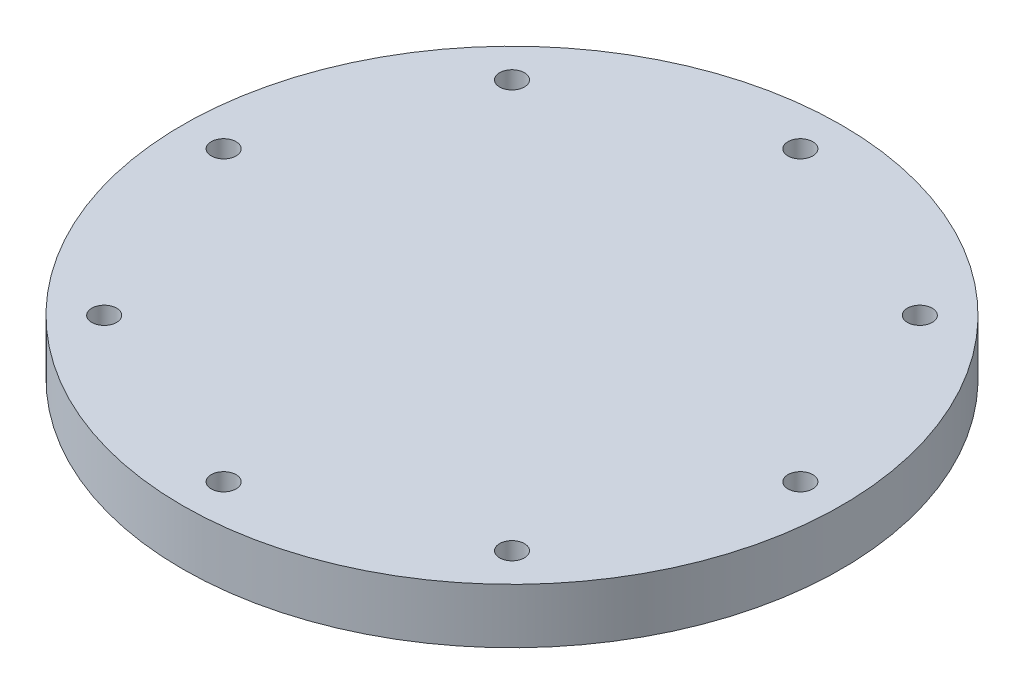
ISO-10303-21;
HEADER;
FILE_DESCRIPTION(('STEP AP214'),'2;1');
FILE_NAME('part.step','',(''),(''),'','','');
FILE_SCHEMA(('AUTOMOTIVE_DESIGN { 1 0 10303 214 1 1 1 1 }'));
ENDSEC;
DATA;
#1=APPLICATION_CONTEXT('core data for automotive mechanical design processes');
#2=APPLICATION_PROTOCOL_DEFINITION('international standard','automotive_design',2000,#1);
#3=PRODUCT_CONTEXT('',#1,'mechanical');
#4=PRODUCT('Part','Part','',(#3));
#5=PRODUCT_RELATED_PRODUCT_CATEGORY('part','',(#4));
#6=PRODUCT_DEFINITION_FORMATION('','',#4);
#7=PRODUCT_DEFINITION_CONTEXT('part definition',#1,'design');
#8=PRODUCT_DEFINITION('design','',#6,#7);
#9=PRODUCT_DEFINITION_SHAPE('','',#8);
#10=(LENGTH_UNIT() NAMED_UNIT(*) SI_UNIT(.MILLI.,.METRE.));
#11=(NAMED_UNIT(*) PLANE_ANGLE_UNIT() SI_UNIT($,.RADIAN.));
#12=(NAMED_UNIT(*) SI_UNIT($,.STERADIAN.) SOLID_ANGLE_UNIT());
#13=UNCERTAINTY_MEASURE_WITH_UNIT(LENGTH_MEASURE(1.E-05),#10,'distance_accuracy_value','');
#14=(GEOMETRIC_REPRESENTATION_CONTEXT(3) GLOBAL_UNCERTAINTY_ASSIGNED_CONTEXT((#13)) GLOBAL_UNIT_ASSIGNED_CONTEXT((#10,
#11,#12)) REPRESENTATION_CONTEXT('',''));
#15=CARTESIAN_POINT('',(0.,0.,0.));
#16=DIRECTION('',(0.,0.,1.));
#17=DIRECTION('',(1.,0.,0.));
#18=AXIS2_PLACEMENT_3D('',#15,#16,#17);
#19=CARTESIAN_POINT('',(0.,6.35,0.));
#20=DIRECTION('',(0.,-1.,0.));
#21=DIRECTION('',(0.,0.,-1.));
#22=AXIS2_PLACEMENT_3D('',#19,#20,#21);
#23=CYLINDRICAL_SURFACE('',#22,38.1);
#24=CARTESIAN_POINT('',(0.,6.35,0.));
#25=DIRECTION('',(0.,1.,0.));
#26=DIRECTION('',(0.,0.,1.));
#27=AXIS2_PLACEMENT_3D('',#24,#25,#26);
#28=CIRCLE('',#27,38.1);
#29=CARTESIAN_POINT('',(0.,6.35,38.1));
#30=VERTEX_POINT('',#29);
#31=EDGE_CURVE('E10',#30,#30,#28,.T.);
#32=ORIENTED_EDGE('',*,*,#31,.F.);
#33=EDGE_LOOP('',(#32));
#34=FACE_BOUND('',#33,.T.);
#35=CARTESIAN_POINT('',(0.,0.,0.));
#36=DIRECTION('',(0.,1.,0.));
#37=DIRECTION('',(0.,0.,1.));
#38=AXIS2_PLACEMENT_3D('',#35,#36,#37);
#39=CIRCLE('',#38,38.1);
#40=CARTESIAN_POINT('',(0.,0.,38.1));
#41=VERTEX_POINT('',#40);
#42=EDGE_CURVE('E33',#41,#41,#39,.T.);
#43=ORIENTED_EDGE('',*,*,#42,.T.);
#44=EDGE_LOOP('',(#43));
#45=FACE_BOUND('',#44,.T.);
#46=ADVANCED_FACE('F30',(#34,#45),#23,.T.);
#47=CARTESIAN_POINT('',(0.,6.35,0.));
#48=DIRECTION('',(0.,1.,0.));
#49=DIRECTION('',(0.,0.,1.));
#50=AXIS2_PLACEMENT_3D('',#47,#48,#49);
#51=PLANE('',#50);
#52=CARTESIAN_POINT('',(-23.5731723178062,6.35,23.5731723178068));
#53=DIRECTION('',(0.,-1.,0.));
#54=DIRECTION('',(0.,0.,-1.));
#55=AXIS2_PLACEMENT_3D('',#52,#53,#54);
#56=CIRCLE('',#55,1.4351);
#57=CARTESIAN_POINT('',(-23.5731723178062,6.35,22.1380723178068));
#58=VERTEX_POINT('',#57);
#59=EDGE_CURVE('E125',#58,#58,#56,.T.);
#60=ORIENTED_EDGE('',*,*,#59,.T.);
#61=EDGE_LOOP('',(#60));
#62=FACE_BOUND('',#61,.T.);
#63=CARTESIAN_POINT('',(-33.3375,6.35,3.49191777401049E-13));
#64=DIRECTION('',(0.,-1.,0.));
#65=DIRECTION('',(0.,0.,-1.));
#66=AXIS2_PLACEMENT_3D('',#63,#64,#65);
#67=CIRCLE('',#66,1.4351);
#68=CARTESIAN_POINT('',(-33.3375,6.35,-1.43509999999965));
#69=VERTEX_POINT('',#68);
#70=EDGE_CURVE('E113',#69,#69,#67,.T.);
#71=ORIENTED_EDGE('',*,*,#70,.T.);
#72=EDGE_LOOP('',(#71));
#73=FACE_BOUND('',#72,.T.);
#74=CARTESIAN_POINT('',(-23.5731723178067,6.35,-23.5731723178063));
#75=DIRECTION('',(0.,-1.,0.));
#76=DIRECTION('',(0.,0.,-1.));
#77=AXIS2_PLACEMENT_3D('',#74,#75,#76);
#78=CIRCLE('',#77,1.4351);
#79=CARTESIAN_POINT('',(-23.5731723178067,6.35,-25.0082723178063));
#80=VERTEX_POINT('',#79);
#81=EDGE_CURVE('E101',#80,#80,#78,.T.);
#82=ORIENTED_EDGE('',*,*,#81,.T.);
#83=EDGE_LOOP('',(#82));
#84=FACE_BOUND('',#83,.T.);
#85=CARTESIAN_POINT('',(0.,6.35,-33.3375));
#86=DIRECTION('',(0.,-1.,0.));
#87=DIRECTION('',(0.,0.,-1.));
#88=AXIS2_PLACEMENT_3D('',#85,#86,#87);
#89=CIRCLE('',#88,1.4351);
#90=CARTESIAN_POINT('',(0.,6.35,-34.7726));
#91=VERTEX_POINT('',#90);
#92=EDGE_CURVE('E89',#91,#91,#89,.T.);
#93=ORIENTED_EDGE('',*,*,#92,.T.);
#94=EDGE_LOOP('',(#93));
#95=FACE_BOUND('',#94,.T.);
#96=CARTESIAN_POINT('',(23.5731723178064,6.35,-23.5731723178067));
#97=DIRECTION('',(0.,-1.,0.));
#98=DIRECTION('',(0.,0.,-1.));
#99=AXIS2_PLACEMENT_3D('',#96,#97,#98);
#100=CIRCLE('',#99,1.4351);
#101=CARTESIAN_POINT('',(23.5731723178064,6.35,-25.0082723178067));
#102=VERTEX_POINT('',#101);
#103=EDGE_CURVE('E77',#102,#102,#100,.T.);
#104=ORIENTED_EDGE('',*,*,#103,.T.);
#105=EDGE_LOOP('',(#104));
#106=FACE_BOUND('',#105,.T.);
#107=CARTESIAN_POINT('',(33.3375,6.35,-1.16397259133683E-13));
#108=DIRECTION('',(0.,-1.,0.));
#109=DIRECTION('',(0.,0.,-1.));
#110=AXIS2_PLACEMENT_3D('',#107,#108,#109);
#111=CIRCLE('',#110,1.4351);
#112=CARTESIAN_POINT('',(33.3375,6.35,-1.43510000000012));
#113=VERTEX_POINT('',#112);
#114=EDGE_CURVE('E65',#113,#113,#111,.T.);
#115=ORIENTED_EDGE('',*,*,#114,.T.);
#116=EDGE_LOOP('',(#115));
#117=FACE_BOUND('',#116,.T.);
#118=CARTESIAN_POINT('',(23.5731723178066,6.35,23.5731723178065));
#119=DIRECTION('',(0.,-1.,0.));
#120=DIRECTION('',(0.,0.,-1.));
#121=AXIS2_PLACEMENT_3D('',#118,#119,#120);
#122=CIRCLE('',#121,1.4351);
#123=CARTESIAN_POINT('',(23.5731723178066,6.35,22.1380723178065));
#124=VERTEX_POINT('',#123);
#125=EDGE_CURVE('E53',#124,#124,#122,.T.);
#126=ORIENTED_EDGE('',*,*,#125,.T.);
#127=EDGE_LOOP('',(#126));
#128=FACE_BOUND('',#127,.T.);
#129=CARTESIAN_POINT('',(0.,6.35,33.3375));
#130=DIRECTION('',(0.,-1.,0.));
#131=DIRECTION('',(0.,0.,-1.));
#132=AXIS2_PLACEMENT_3D('',#129,#130,#131);
#133=CIRCLE('',#132,1.4351);
#134=CARTESIAN_POINT('',(0.,6.35,31.9024));
#135=VERTEX_POINT('',#134);
#136=EDGE_CURVE('E40',#135,#135,#133,.T.);
#137=ORIENTED_EDGE('',*,*,#136,.T.);
#138=EDGE_LOOP('',(#137));
#139=FACE_BOUND('',#138,.T.);
#140=ORIENTED_EDGE('',*,*,#31,.T.);
#141=EDGE_LOOP('',(#140));
#142=FACE_BOUND('',#141,.T.);
#143=ADVANCED_FACE('F144',(#62,#73,#84,#95,#106,#117,#128,#139,#142),#51,.T.);
#144=CARTESIAN_POINT('',(0.,0.,0.));
#145=DIRECTION('',(0.,1.,0.));
#146=DIRECTION('',(0.,0.,1.));
#147=AXIS2_PLACEMENT_3D('',#144,#145,#146);
#148=PLANE('',#147);
#149=CARTESIAN_POINT('',(-23.5731723178062,0.,23.5731723178068));
#150=DIRECTION('',(0.,-1.,0.));
#151=DIRECTION('',(0.,0.,-1.));
#152=AXIS2_PLACEMENT_3D('',#149,#150,#151);
#153=CIRCLE('',#152,2.413);
#154=CARTESIAN_POINT('',(-23.5731723178062,0.,21.1601723178068));
#155=VERTEX_POINT('',#154);
#156=EDGE_CURVE('E134',#155,#155,#153,.T.);
#157=ORIENTED_EDGE('',*,*,#156,.F.);
#158=EDGE_LOOP('',(#157));
#159=FACE_BOUND('',#158,.T.);
#160=CARTESIAN_POINT('',(-33.3375,0.,3.49191777401049E-13));
#161=DIRECTION('',(0.,-1.,0.));
#162=DIRECTION('',(0.,0.,-1.));
#163=AXIS2_PLACEMENT_3D('',#160,#161,#162);
#164=CIRCLE('',#163,2.413);
#165=CARTESIAN_POINT('',(-33.3375,0.,-2.41299999999965));
#166=VERTEX_POINT('',#165);
#167=EDGE_CURVE('E122',#166,#166,#164,.T.);
#168=ORIENTED_EDGE('',*,*,#167,.F.);
#169=EDGE_LOOP('',(#168));
#170=FACE_BOUND('',#169,.T.);
#171=CARTESIAN_POINT('',(-23.5731723178067,0.,-23.5731723178063));
#172=DIRECTION('',(0.,-1.,0.));
#173=DIRECTION('',(0.,0.,-1.));
#174=AXIS2_PLACEMENT_3D('',#171,#172,#173);
#175=CIRCLE('',#174,2.413);
#176=CARTESIAN_POINT('',(-23.5731723178067,0.,-25.9861723178063));
#177=VERTEX_POINT('',#176);
#178=EDGE_CURVE('E110',#177,#177,#175,.T.);
#179=ORIENTED_EDGE('',*,*,#178,.F.);
#180=EDGE_LOOP('',(#179));
#181=FACE_BOUND('',#180,.T.);
#182=CARTESIAN_POINT('',(0.,0.,-33.3375));
#183=DIRECTION('',(0.,-1.,0.));
#184=DIRECTION('',(0.,0.,-1.));
#185=AXIS2_PLACEMENT_3D('',#182,#183,#184);
#186=CIRCLE('',#185,2.413);
#187=CARTESIAN_POINT('',(0.,0.,-35.7505));
#188=VERTEX_POINT('',#187);
#189=EDGE_CURVE('E98',#188,#188,#186,.T.);
#190=ORIENTED_EDGE('',*,*,#189,.F.);
#191=EDGE_LOOP('',(#190));
#192=FACE_BOUND('',#191,.T.);
#193=CARTESIAN_POINT('',(23.5731723178064,0.,-23.5731723178067));
#194=DIRECTION('',(0.,-1.,0.));
#195=DIRECTION('',(0.,0.,-1.));
#196=AXIS2_PLACEMENT_3D('',#193,#194,#195);
#197=CIRCLE('',#196,2.413);
#198=CARTESIAN_POINT('',(23.5731723178064,0.,-25.9861723178067));
#199=VERTEX_POINT('',#198);
#200=EDGE_CURVE('E86',#199,#199,#197,.T.);
#201=ORIENTED_EDGE('',*,*,#200,.F.);
#202=EDGE_LOOP('',(#201));
#203=FACE_BOUND('',#202,.T.);
#204=CARTESIAN_POINT('',(33.3375,0.,-1.16397259133683E-13));
#205=DIRECTION('',(0.,-1.,0.));
#206=DIRECTION('',(0.,0.,-1.));
#207=AXIS2_PLACEMENT_3D('',#204,#205,#206);
#208=CIRCLE('',#207,2.413);
#209=CARTESIAN_POINT('',(33.3375,0.,-2.41300000000011));
#210=VERTEX_POINT('',#209);
#211=EDGE_CURVE('E74',#210,#210,#208,.T.);
#212=ORIENTED_EDGE('',*,*,#211,.F.);
#213=EDGE_LOOP('',(#212));
#214=FACE_BOUND('',#213,.T.);
#215=CARTESIAN_POINT('',(23.5731723178066,0.,23.5731723178065));
#216=DIRECTION('',(0.,-1.,0.));
#217=DIRECTION('',(0.,0.,-1.));
#218=AXIS2_PLACEMENT_3D('',#215,#216,#217);
#219=CIRCLE('',#218,2.413);
#220=CARTESIAN_POINT('',(23.5731723178066,0.,21.1601723178065));
#221=VERTEX_POINT('',#220);
#222=EDGE_CURVE('E62',#221,#221,#219,.T.);
#223=ORIENTED_EDGE('',*,*,#222,.F.);
#224=EDGE_LOOP('',(#223));
#225=FACE_BOUND('',#224,.T.);
#226=CARTESIAN_POINT('',(0.,0.,33.3375));
#227=DIRECTION('',(0.,-1.,0.));
#228=DIRECTION('',(0.,0.,-1.));
#229=AXIS2_PLACEMENT_3D('',#226,#227,#228);
#230=CIRCLE('',#229,2.413);
#231=CARTESIAN_POINT('',(0.,0.,30.9245));
#232=VERTEX_POINT('',#231);
#233=EDGE_CURVE('E50',#232,#232,#230,.T.);
#234=ORIENTED_EDGE('',*,*,#233,.F.);
#235=EDGE_LOOP('',(#234));
#236=FACE_BOUND('',#235,.T.);
#237=ORIENTED_EDGE('',*,*,#42,.F.);
#238=EDGE_LOOP('',(#237));
#239=FACE_BOUND('',#238,.T.);
#240=ADVANCED_FACE('F140',(#159,#170,#181,#192,#203,#214,#225,#236,#239),#148,.F.);
#241=CARTESIAN_POINT('',(0.,0.,33.3375));
#242=DIRECTION('',(0.,-1.,0.));
#243=DIRECTION('',(0.,0.,-1.));
#244=AXIS2_PLACEMENT_3D('',#241,#242,#243);
#245=CYLINDRICAL_SURFACE('',#244,1.4351);
#246=ORIENTED_EDGE('',*,*,#136,.F.);
#247=EDGE_LOOP('',(#246));
#248=FACE_BOUND('',#247,.T.);
#249=CARTESIAN_POINT('',(0.,1.905,33.3375));
#250=DIRECTION('',(0.,-1.,0.));
#251=DIRECTION('',(0.,0.,-1.));
#252=AXIS2_PLACEMENT_3D('',#249,#250,#251);
#253=CIRCLE('',#252,1.4351);
#254=CARTESIAN_POINT('',(0.,1.905,31.9024));
#255=VERTEX_POINT('',#254);
#256=EDGE_CURVE('E44',#255,#255,#253,.T.);
#257=ORIENTED_EDGE('',*,*,#256,.T.);
#258=EDGE_LOOP('',(#257));
#259=FACE_BOUND('',#258,.T.);
#260=ADVANCED_FACE('F143',(#248,#259),#245,.F.);
#261=CARTESIAN_POINT('',(1.4351,1.905,33.3375));
#262=DIRECTION('',(0.,1.,0.));
#263=DIRECTION('',(0.,0.,1.));
#264=AXIS2_PLACEMENT_3D('',#261,#262,#263);
#265=PLANE('',#264);
#266=ORIENTED_EDGE('',*,*,#256,.F.);
#267=EDGE_LOOP('',(#266));
#268=FACE_BOUND('',#267,.T.);
#269=CARTESIAN_POINT('',(0.,1.905,33.3375));
#270=DIRECTION('',(0.,-1.,0.));
#271=DIRECTION('',(0.,0.,-1.));
#272=AXIS2_PLACEMENT_3D('',#269,#270,#271);
#273=CIRCLE('',#272,2.413);
#274=CARTESIAN_POINT('',(0.,1.905,30.9245));
#275=VERTEX_POINT('',#274);
#276=EDGE_CURVE('E47',#275,#275,#273,.T.);
#277=ORIENTED_EDGE('',*,*,#276,.T.);
#278=EDGE_LOOP('',(#277));
#279=FACE_BOUND('',#278,.T.);
#280=ADVANCED_FACE('F174',(#268,#279),#265,.F.);
#281=CARTESIAN_POINT('',(0.,0.,33.3375));
#282=DIRECTION('',(0.,-1.,0.));
#283=DIRECTION('',(0.,0.,-1.));
#284=AXIS2_PLACEMENT_3D('',#281,#282,#283);
#285=CYLINDRICAL_SURFACE('',#284,2.413);
#286=ORIENTED_EDGE('',*,*,#276,.F.);
#287=EDGE_LOOP('',(#286));
#288=FACE_BOUND('',#287,.T.);
#289=ORIENTED_EDGE('',*,*,#233,.T.);
#290=EDGE_LOOP('',(#289));
#291=FACE_BOUND('',#290,.T.);
#292=ADVANCED_FACE('F178',(#288,#291),#285,.F.);
#293=CARTESIAN_POINT('',(23.5731723178066,0.,23.5731723178065));
#294=DIRECTION('',(0.,-1.,0.));
#295=DIRECTION('',(0.,0.,-1.));
#296=AXIS2_PLACEMENT_3D('',#293,#294,#295);
#297=CYLINDRICAL_SURFACE('',#296,1.4351);
#298=ORIENTED_EDGE('',*,*,#125,.F.);
#299=EDGE_LOOP('',(#298));
#300=FACE_BOUND('',#299,.T.);
#301=CARTESIAN_POINT('',(23.5731723178066,1.905,23.5731723178065));
#302=DIRECTION('',(0.,-1.,0.));
#303=DIRECTION('',(0.,0.,-1.));
#304=AXIS2_PLACEMENT_3D('',#301,#302,#303);
#305=CIRCLE('',#304,1.4351);
#306=CARTESIAN_POINT('',(23.5731723178066,1.905,22.1380723178065));
#307=VERTEX_POINT('',#306);
#308=EDGE_CURVE('E56',#307,#307,#305,.T.);
#309=ORIENTED_EDGE('',*,*,#308,.T.);
#310=EDGE_LOOP('',(#309));
#311=FACE_BOUND('',#310,.T.);
#312=ADVANCED_FACE('F182',(#300,#311),#297,.F.);
#313=CARTESIAN_POINT('',(25.0082723178066,1.905,23.5731723178065));
#314=DIRECTION('',(0.,1.,0.));
#315=DIRECTION('',(0.,0.,1.));
#316=AXIS2_PLACEMENT_3D('',#313,#314,#315);
#317=PLANE('',#316);
#318=ORIENTED_EDGE('',*,*,#308,.F.);
#319=EDGE_LOOP('',(#318));
#320=FACE_BOUND('',#319,.T.);
#321=CARTESIAN_POINT('',(23.5731723178066,1.905,23.5731723178065));
#322=DIRECTION('',(0.,-1.,0.));
#323=DIRECTION('',(0.,0.,-1.));
#324=AXIS2_PLACEMENT_3D('',#321,#322,#323);
#325=CIRCLE('',#324,2.413);
#326=CARTESIAN_POINT('',(23.5731723178066,1.905,21.1601723178065));
#327=VERTEX_POINT('',#326);
#328=EDGE_CURVE('E59',#327,#327,#325,.T.);
#329=ORIENTED_EDGE('',*,*,#328,.T.);
#330=EDGE_LOOP('',(#329));
#331=FACE_BOUND('',#330,.T.);
#332=ADVANCED_FACE('F186',(#320,#331),#317,.F.);
#333=CARTESIAN_POINT('',(23.5731723178066,0.,23.5731723178065));
#334=DIRECTION('',(0.,-1.,0.));
#335=DIRECTION('',(0.,0.,-1.));
#336=AXIS2_PLACEMENT_3D('',#333,#334,#335);
#337=CYLINDRICAL_SURFACE('',#336,2.413);
#338=ORIENTED_EDGE('',*,*,#328,.F.);
#339=EDGE_LOOP('',(#338));
#340=FACE_BOUND('',#339,.T.);
#341=ORIENTED_EDGE('',*,*,#222,.T.);
#342=EDGE_LOOP('',(#341));
#343=FACE_BOUND('',#342,.T.);
#344=ADVANCED_FACE('F190',(#340,#343),#337,.F.);
#345=CARTESIAN_POINT('',(33.3375,0.,-1.16397259133683E-13));
#346=DIRECTION('',(0.,-1.,0.));
#347=DIRECTION('',(0.,0.,-1.));
#348=AXIS2_PLACEMENT_3D('',#345,#346,#347);
#349=CYLINDRICAL_SURFACE('',#348,1.4351);
#350=ORIENTED_EDGE('',*,*,#114,.F.);
#351=EDGE_LOOP('',(#350));
#352=FACE_BOUND('',#351,.T.);
#353=CARTESIAN_POINT('',(33.3375,1.905,-1.16397259133683E-13));
#354=DIRECTION('',(0.,-1.,0.));
#355=DIRECTION('',(0.,0.,-1.));
#356=AXIS2_PLACEMENT_3D('',#353,#354,#355);
#357=CIRCLE('',#356,1.4351);
#358=CARTESIAN_POINT('',(33.3375,1.905,-1.43510000000012));
#359=VERTEX_POINT('',#358);
#360=EDGE_CURVE('E68',#359,#359,#357,.T.);
#361=ORIENTED_EDGE('',*,*,#360,.T.);
#362=EDGE_LOOP('',(#361));
#363=FACE_BOUND('',#362,.T.);
#364=ADVANCED_FACE('F194',(#352,#363),#349,.F.);
#365=CARTESIAN_POINT('',(34.7726,1.905,-1.16397259133683E-13));
#366=DIRECTION('',(0.,1.,0.));
#367=DIRECTION('',(0.,0.,1.));
#368=AXIS2_PLACEMENT_3D('',#365,#366,#367);
#369=PLANE('',#368);
#370=ORIENTED_EDGE('',*,*,#360,.F.);
#371=EDGE_LOOP('',(#370));
#372=FACE_BOUND('',#371,.T.);
#373=CARTESIAN_POINT('',(33.3375,1.905,-1.16397259133683E-13));
#374=DIRECTION('',(0.,-1.,0.));
#375=DIRECTION('',(0.,0.,-1.));
#376=AXIS2_PLACEMENT_3D('',#373,#374,#375);
#377=CIRCLE('',#376,2.413);
#378=CARTESIAN_POINT('',(33.3375,1.905,-2.41300000000011));
#379=VERTEX_POINT('',#378);
#380=EDGE_CURVE('E71',#379,#379,#377,.T.);
#381=ORIENTED_EDGE('',*,*,#380,.T.);
#382=EDGE_LOOP('',(#381));
#383=FACE_BOUND('',#382,.T.);
#384=ADVANCED_FACE('F198',(#372,#383),#369,.F.);
#385=CARTESIAN_POINT('',(33.3375,0.,-1.16397259133683E-13));
#386=DIRECTION('',(0.,-1.,0.));
#387=DIRECTION('',(0.,0.,-1.));
#388=AXIS2_PLACEMENT_3D('',#385,#386,#387);
#389=CYLINDRICAL_SURFACE('',#388,2.413);
#390=ORIENTED_EDGE('',*,*,#380,.F.);
#391=EDGE_LOOP('',(#390));
#392=FACE_BOUND('',#391,.T.);
#393=ORIENTED_EDGE('',*,*,#211,.T.);
#394=EDGE_LOOP('',(#393));
#395=FACE_BOUND('',#394,.T.);
#396=ADVANCED_FACE('F202',(#392,#395),#389,.F.);
#397=CARTESIAN_POINT('',(23.5731723178064,0.,-23.5731723178067));
#398=DIRECTION('',(0.,-1.,0.));
#399=DIRECTION('',(0.,0.,-1.));
#400=AXIS2_PLACEMENT_3D('',#397,#398,#399);
#401=CYLINDRICAL_SURFACE('',#400,1.4351);
#402=ORIENTED_EDGE('',*,*,#103,.F.);
#403=EDGE_LOOP('',(#402));
#404=FACE_BOUND('',#403,.T.);
#405=CARTESIAN_POINT('',(23.5731723178064,1.905,-23.5731723178067));
#406=DIRECTION('',(0.,-1.,0.));
#407=DIRECTION('',(0.,0.,-1.));
#408=AXIS2_PLACEMENT_3D('',#405,#406,#407);
#409=CIRCLE('',#408,1.4351);
#410=CARTESIAN_POINT('',(23.5731723178064,1.905,-25.0082723178067));
#411=VERTEX_POINT('',#410);
#412=EDGE_CURVE('E80',#411,#411,#409,.T.);
#413=ORIENTED_EDGE('',*,*,#412,.T.);
#414=EDGE_LOOP('',(#413));
#415=FACE_BOUND('',#414,.T.);
#416=ADVANCED_FACE('F206',(#404,#415),#401,.F.);
#417=CARTESIAN_POINT('',(25.0082723178064,1.905,-23.5731723178067));
#418=DIRECTION('',(0.,1.,0.));
#419=DIRECTION('',(0.,0.,1.));
#420=AXIS2_PLACEMENT_3D('',#417,#418,#419);
#421=PLANE('',#420);
#422=ORIENTED_EDGE('',*,*,#412,.F.);
#423=EDGE_LOOP('',(#422));
#424=FACE_BOUND('',#423,.T.);
#425=CARTESIAN_POINT('',(23.5731723178064,1.905,-23.5731723178067));
#426=DIRECTION('',(0.,-1.,0.));
#427=DIRECTION('',(0.,0.,-1.));
#428=AXIS2_PLACEMENT_3D('',#425,#426,#427);
#429=CIRCLE('',#428,2.413);
#430=CARTESIAN_POINT('',(23.5731723178064,1.905,-25.9861723178067));
#431=VERTEX_POINT('',#430);
#432=EDGE_CURVE('E83',#431,#431,#429,.T.);
#433=ORIENTED_EDGE('',*,*,#432,.T.);
#434=EDGE_LOOP('',(#433));
#435=FACE_BOUND('',#434,.T.);
#436=ADVANCED_FACE('F210',(#424,#435),#421,.F.);
#437=CARTESIAN_POINT('',(23.5731723178064,0.,-23.5731723178067));
#438=DIRECTION('',(0.,-1.,0.));
#439=DIRECTION('',(0.,0.,-1.));
#440=AXIS2_PLACEMENT_3D('',#437,#438,#439);
#441=CYLINDRICAL_SURFACE('',#440,2.413);
#442=ORIENTED_EDGE('',*,*,#432,.F.);
#443=EDGE_LOOP('',(#442));
#444=FACE_BOUND('',#443,.T.);
#445=ORIENTED_EDGE('',*,*,#200,.T.);
#446=EDGE_LOOP('',(#445));
#447=FACE_BOUND('',#446,.T.);
#448=ADVANCED_FACE('F214',(#444,#447),#441,.F.);
#449=CARTESIAN_POINT('',(0.,0.,-33.3375));
#450=DIRECTION('',(0.,-1.,0.));
#451=DIRECTION('',(0.,0.,-1.));
#452=AXIS2_PLACEMENT_3D('',#449,#450,#451);
#453=CYLINDRICAL_SURFACE('',#452,1.4351);
#454=ORIENTED_EDGE('',*,*,#92,.F.);
#455=EDGE_LOOP('',(#454));
#456=FACE_BOUND('',#455,.T.);
#457=CARTESIAN_POINT('',(0.,1.905,-33.3375));
#458=DIRECTION('',(0.,-1.,0.));
#459=DIRECTION('',(0.,0.,-1.));
#460=AXIS2_PLACEMENT_3D('',#457,#458,#459);
#461=CIRCLE('',#460,1.4351);
#462=CARTESIAN_POINT('',(0.,1.905,-34.7726));
#463=VERTEX_POINT('',#462);
#464=EDGE_CURVE('E92',#463,#463,#461,.T.);
#465=ORIENTED_EDGE('',*,*,#464,.T.);
#466=EDGE_LOOP('',(#465));
#467=FACE_BOUND('',#466,.T.);
#468=ADVANCED_FACE('F218',(#456,#467),#453,.F.);
#469=CARTESIAN_POINT('',(1.4351,1.905,-33.3375));
#470=DIRECTION('',(0.,1.,0.));
#471=DIRECTION('',(0.,0.,1.));
#472=AXIS2_PLACEMENT_3D('',#469,#470,#471);
#473=PLANE('',#472);
#474=ORIENTED_EDGE('',*,*,#464,.F.);
#475=EDGE_LOOP('',(#474));
#476=FACE_BOUND('',#475,.T.);
#477=CARTESIAN_POINT('',(0.,1.905,-33.3375));
#478=DIRECTION('',(0.,-1.,0.));
#479=DIRECTION('',(0.,0.,-1.));
#480=AXIS2_PLACEMENT_3D('',#477,#478,#479);
#481=CIRCLE('',#480,2.413);
#482=CARTESIAN_POINT('',(0.,1.905,-35.7505));
#483=VERTEX_POINT('',#482);
#484=EDGE_CURVE('E95',#483,#483,#481,.T.);
#485=ORIENTED_EDGE('',*,*,#484,.T.);
#486=EDGE_LOOP('',(#485));
#487=FACE_BOUND('',#486,.T.);
#488=ADVANCED_FACE('F222',(#476,#487),#473,.F.);
#489=CARTESIAN_POINT('',(0.,0.,-33.3375));
#490=DIRECTION('',(0.,-1.,0.));
#491=DIRECTION('',(0.,0.,-1.));
#492=AXIS2_PLACEMENT_3D('',#489,#490,#491);
#493=CYLINDRICAL_SURFACE('',#492,2.413);
#494=ORIENTED_EDGE('',*,*,#484,.F.);
#495=EDGE_LOOP('',(#494));
#496=FACE_BOUND('',#495,.T.);
#497=ORIENTED_EDGE('',*,*,#189,.T.);
#498=EDGE_LOOP('',(#497));
#499=FACE_BOUND('',#498,.T.);
#500=ADVANCED_FACE('F226',(#496,#499),#493,.F.);
#501=CARTESIAN_POINT('',(-23.5731723178067,0.,-23.5731723178063));
#502=DIRECTION('',(0.,-1.,0.));
#503=DIRECTION('',(0.,0.,-1.));
#504=AXIS2_PLACEMENT_3D('',#501,#502,#503);
#505=CYLINDRICAL_SURFACE('',#504,1.4351);
#506=ORIENTED_EDGE('',*,*,#81,.F.);
#507=EDGE_LOOP('',(#506));
#508=FACE_BOUND('',#507,.T.);
#509=CARTESIAN_POINT('',(-23.5731723178067,1.905,-23.5731723178063));
#510=DIRECTION('',(0.,-1.,0.));
#511=DIRECTION('',(0.,0.,-1.));
#512=AXIS2_PLACEMENT_3D('',#509,#510,#511);
#513=CIRCLE('',#512,1.4351);
#514=CARTESIAN_POINT('',(-23.5731723178067,1.905,-25.0082723178063));
#515=VERTEX_POINT('',#514);
#516=EDGE_CURVE('E104',#515,#515,#513,.T.);
#517=ORIENTED_EDGE('',*,*,#516,.T.);
#518=EDGE_LOOP('',(#517));
#519=FACE_BOUND('',#518,.T.);
#520=ADVANCED_FACE('F230',(#508,#519),#505,.F.);
#521=CARTESIAN_POINT('',(-22.1380723178067,1.905,-23.5731723178063));
#522=DIRECTION('',(0.,1.,0.));
#523=DIRECTION('',(0.,0.,1.));
#524=AXIS2_PLACEMENT_3D('',#521,#522,#523);
#525=PLANE('',#524);
#526=ORIENTED_EDGE('',*,*,#516,.F.);
#527=EDGE_LOOP('',(#526));
#528=FACE_BOUND('',#527,.T.);
#529=CARTESIAN_POINT('',(-23.5731723178067,1.905,-23.5731723178063));
#530=DIRECTION('',(0.,-1.,0.));
#531=DIRECTION('',(0.,0.,-1.));
#532=AXIS2_PLACEMENT_3D('',#529,#530,#531);
#533=CIRCLE('',#532,2.413);
#534=CARTESIAN_POINT('',(-23.5731723178067,1.905,-25.9861723178063));
#535=VERTEX_POINT('',#534);
#536=EDGE_CURVE('E107',#535,#535,#533,.T.);
#537=ORIENTED_EDGE('',*,*,#536,.T.);
#538=EDGE_LOOP('',(#537));
#539=FACE_BOUND('',#538,.T.);
#540=ADVANCED_FACE('F234',(#528,#539),#525,.F.);
#541=CARTESIAN_POINT('',(-23.5731723178067,0.,-23.5731723178063));
#542=DIRECTION('',(0.,-1.,0.));
#543=DIRECTION('',(0.,0.,-1.));
#544=AXIS2_PLACEMENT_3D('',#541,#542,#543);
#545=CYLINDRICAL_SURFACE('',#544,2.413);
#546=ORIENTED_EDGE('',*,*,#536,.F.);
#547=EDGE_LOOP('',(#546));
#548=FACE_BOUND('',#547,.T.);
#549=ORIENTED_EDGE('',*,*,#178,.T.);
#550=EDGE_LOOP('',(#549));
#551=FACE_BOUND('',#550,.T.);
#552=ADVANCED_FACE('F238',(#548,#551),#545,.F.);
#553=CARTESIAN_POINT('',(-33.3375,0.,3.49191777401049E-13));
#554=DIRECTION('',(0.,-1.,0.));
#555=DIRECTION('',(0.,0.,-1.));
#556=AXIS2_PLACEMENT_3D('',#553,#554,#555);
#557=CYLINDRICAL_SURFACE('',#556,1.4351);
#558=ORIENTED_EDGE('',*,*,#70,.F.);
#559=EDGE_LOOP('',(#558));
#560=FACE_BOUND('',#559,.T.);
#561=CARTESIAN_POINT('',(-33.3375,1.905,3.49191777401049E-13));
#562=DIRECTION('',(0.,-1.,0.));
#563=DIRECTION('',(0.,0.,-1.));
#564=AXIS2_PLACEMENT_3D('',#561,#562,#563);
#565=CIRCLE('',#564,1.4351);
#566=CARTESIAN_POINT('',(-33.3375,1.905,-1.43509999999965));
#567=VERTEX_POINT('',#566);
#568=EDGE_CURVE('E116',#567,#567,#565,.T.);
#569=ORIENTED_EDGE('',*,*,#568,.T.);
#570=EDGE_LOOP('',(#569));
#571=FACE_BOUND('',#570,.T.);
#572=ADVANCED_FACE('F242',(#560,#571),#557,.F.);
#573=CARTESIAN_POINT('',(-31.9024,1.905,3.49191777401049E-13));
#574=DIRECTION('',(0.,1.,0.));
#575=DIRECTION('',(0.,0.,1.));
#576=AXIS2_PLACEMENT_3D('',#573,#574,#575);
#577=PLANE('',#576);
#578=ORIENTED_EDGE('',*,*,#568,.F.);
#579=EDGE_LOOP('',(#578));
#580=FACE_BOUND('',#579,.T.);
#581=CARTESIAN_POINT('',(-33.3375,1.905,3.49191777401049E-13));
#582=DIRECTION('',(0.,-1.,0.));
#583=DIRECTION('',(0.,0.,-1.));
#584=AXIS2_PLACEMENT_3D('',#581,#582,#583);
#585=CIRCLE('',#584,2.413);
#586=CARTESIAN_POINT('',(-33.3375,1.905,-2.41299999999965));
#587=VERTEX_POINT('',#586);
#588=EDGE_CURVE('E119',#587,#587,#585,.T.);
#589=ORIENTED_EDGE('',*,*,#588,.T.);
#590=EDGE_LOOP('',(#589));
#591=FACE_BOUND('',#590,.T.);
#592=ADVANCED_FACE('F246',(#580,#591),#577,.F.);
#593=CARTESIAN_POINT('',(-33.3375,0.,3.49191777401049E-13));
#594=DIRECTION('',(0.,-1.,0.));
#595=DIRECTION('',(0.,0.,-1.));
#596=AXIS2_PLACEMENT_3D('',#593,#594,#595);
#597=CYLINDRICAL_SURFACE('',#596,2.413);
#598=ORIENTED_EDGE('',*,*,#588,.F.);
#599=EDGE_LOOP('',(#598));
#600=FACE_BOUND('',#599,.T.);
#601=ORIENTED_EDGE('',*,*,#167,.T.);
#602=EDGE_LOOP('',(#601));
#603=FACE_BOUND('',#602,.T.);
#604=ADVANCED_FACE('F250',(#600,#603),#597,.F.);
#605=CARTESIAN_POINT('',(-23.5731723178062,0.,23.5731723178068));
#606=DIRECTION('',(0.,-1.,0.));
#607=DIRECTION('',(0.,0.,-1.));
#608=AXIS2_PLACEMENT_3D('',#605,#606,#607);
#609=CYLINDRICAL_SURFACE('',#608,1.4351);
#610=ORIENTED_EDGE('',*,*,#59,.F.);
#611=EDGE_LOOP('',(#610));
#612=FACE_BOUND('',#611,.T.);
#613=CARTESIAN_POINT('',(-23.5731723178062,1.905,23.5731723178068));
#614=DIRECTION('',(0.,-1.,0.));
#615=DIRECTION('',(0.,0.,-1.));
#616=AXIS2_PLACEMENT_3D('',#613,#614,#615);
#617=CIRCLE('',#616,1.4351);
#618=CARTESIAN_POINT('',(-23.5731723178062,1.905,22.1380723178068));
#619=VERTEX_POINT('',#618);
#620=EDGE_CURVE('E128',#619,#619,#617,.T.);
#621=ORIENTED_EDGE('',*,*,#620,.T.);
#622=EDGE_LOOP('',(#621));
#623=FACE_BOUND('',#622,.T.);
#624=ADVANCED_FACE('F254',(#612,#623),#609,.F.);
#625=CARTESIAN_POINT('',(-22.1380723178062,1.905,23.5731723178068));
#626=DIRECTION('',(0.,1.,0.));
#627=DIRECTION('',(0.,0.,1.));
#628=AXIS2_PLACEMENT_3D('',#625,#626,#627);
#629=PLANE('',#628);
#630=ORIENTED_EDGE('',*,*,#620,.F.);
#631=EDGE_LOOP('',(#630));
#632=FACE_BOUND('',#631,.T.);
#633=CARTESIAN_POINT('',(-23.5731723178062,1.905,23.5731723178068));
#634=DIRECTION('',(0.,-1.,0.));
#635=DIRECTION('',(0.,0.,-1.));
#636=AXIS2_PLACEMENT_3D('',#633,#634,#635);
#637=CIRCLE('',#636,2.413);
#638=CARTESIAN_POINT('',(-23.5731723178062,1.905,21.1601723178068));
#639=VERTEX_POINT('',#638);
#640=EDGE_CURVE('E131',#639,#639,#637,.T.);
#641=ORIENTED_EDGE('',*,*,#640,.T.);
#642=EDGE_LOOP('',(#641));
#643=FACE_BOUND('',#642,.T.);
#644=ADVANCED_FACE('F258',(#632,#643),#629,.F.);
#645=CARTESIAN_POINT('',(-23.5731723178062,0.,23.5731723178068));
#646=DIRECTION('',(0.,-1.,0.));
#647=DIRECTION('',(0.,0.,-1.));
#648=AXIS2_PLACEMENT_3D('',#645,#646,#647);
#649=CYLINDRICAL_SURFACE('',#648,2.413);
#650=ORIENTED_EDGE('',*,*,#640,.F.);
#651=EDGE_LOOP('',(#650));
#652=FACE_BOUND('',#651,.T.);
#653=ORIENTED_EDGE('',*,*,#156,.T.);
#654=EDGE_LOOP('',(#653));
#655=FACE_BOUND('',#654,.T.);
#656=ADVANCED_FACE('F138',(#652,#655),#649,.F.);
#657=CLOSED_SHELL('',(#46,#143,#240,#260,#280,#292,#312,#332,#344,#364,#384,#396,#416,#436,#448,
#468,#488,#500,#520,#540,#552,#572,#592,#604,#624,#644,#656));
#658=MANIFOLD_SOLID_BREP('B2',#657);
#659=ADVANCED_BREP_SHAPE_REPRESENTATION('',(#18,#658),#14);
#660=SHAPE_DEFINITION_REPRESENTATION(#9,#659);
ENDSEC;
END-ISO-10303-21;
